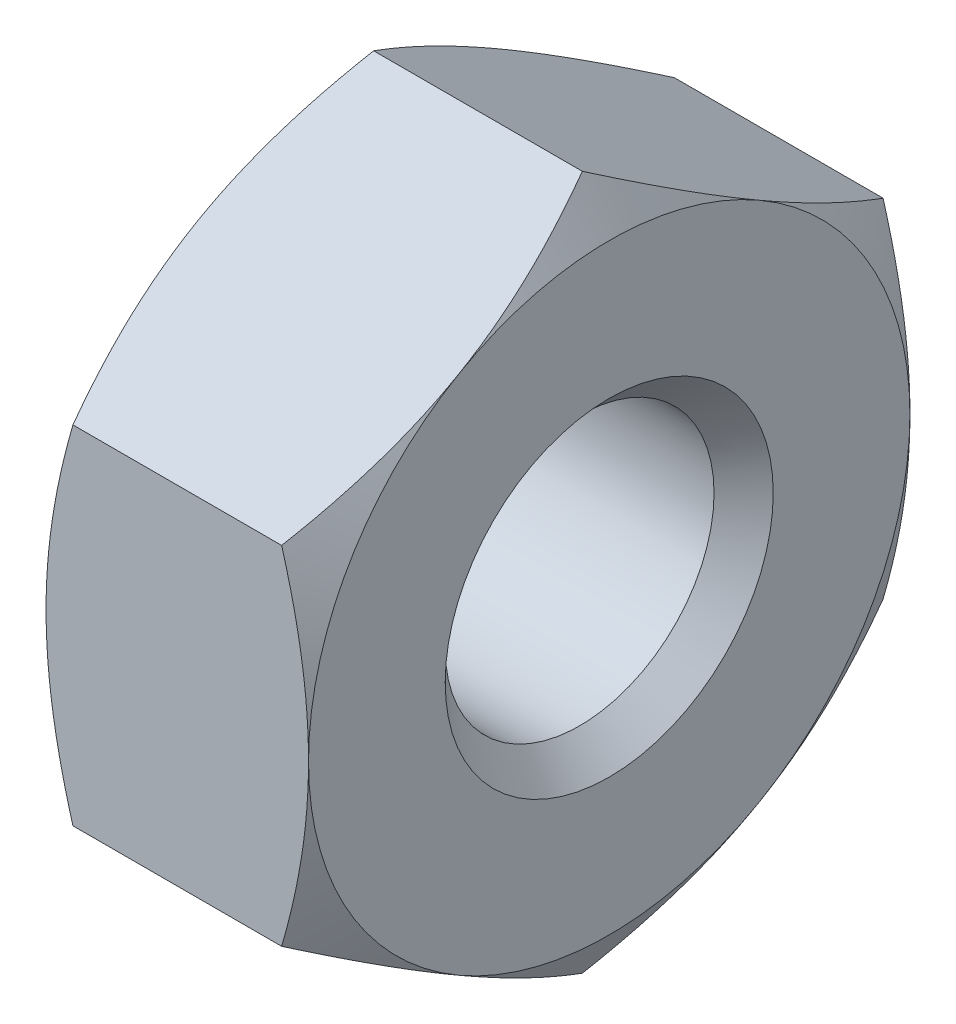
ISO-10303-21;
HEADER;
FILE_DESCRIPTION(('STEP AP214'),'2;1');
FILE_NAME('part.step','',(''),(''),'','','');
FILE_SCHEMA(('AUTOMOTIVE_DESIGN { 1 0 10303 214 1 1 1 1 }'));
ENDSEC;
DATA;
#1=APPLICATION_CONTEXT('core data for automotive mechanical design processes');
#2=APPLICATION_PROTOCOL_DEFINITION('international standard','automotive_design',2000,#1);
#3=PRODUCT_CONTEXT('',#1,'mechanical');
#4=PRODUCT('Part','Part','',(#3));
#5=PRODUCT_RELATED_PRODUCT_CATEGORY('part','',(#4));
#6=PRODUCT_DEFINITION_FORMATION('','',#4);
#7=PRODUCT_DEFINITION_CONTEXT('part definition',#1,'design');
#8=PRODUCT_DEFINITION('design','',#6,#7);
#9=PRODUCT_DEFINITION_SHAPE('','',#8);
#10=(LENGTH_UNIT() NAMED_UNIT(*) SI_UNIT(.MILLI.,.METRE.));
#11=(NAMED_UNIT(*) PLANE_ANGLE_UNIT() SI_UNIT($,.RADIAN.));
#12=(NAMED_UNIT(*) SI_UNIT($,.STERADIAN.) SOLID_ANGLE_UNIT());
#13=UNCERTAINTY_MEASURE_WITH_UNIT(LENGTH_MEASURE(1.E-05),#10,'distance_accuracy_value','');
#14=(GEOMETRIC_REPRESENTATION_CONTEXT(3) GLOBAL_UNCERTAINTY_ASSIGNED_CONTEXT((#13)) GLOBAL_UNIT_ASSIGNED_CONTEXT((#10,
#11,#12)) REPRESENTATION_CONTEXT('',''));
#15=CARTESIAN_POINT('',(0.,0.,0.));
#16=DIRECTION('',(0.,0.,1.));
#17=DIRECTION('',(1.,0.,0.));
#18=AXIS2_PLACEMENT_3D('',#15,#16,#17);
#19=CARTESIAN_POINT('',(0.,0.,0.));
#20=DIRECTION('',(1.,0.,0.));
#21=DIRECTION('',(0.,0.,1.));
#22=AXIS2_PLACEMENT_3D('',#19,#20,#21);
#23=CONICAL_SURFACE('',#22,2.75,1.0471975511966);
#24=CARTESIAN_POINT('',(0.245620759728892,3.17542763524348,1.99999999944489E-06));
#25=CARTESIAN_POINT('',(0.205327079520912,3.1056572343859,-0.120843879149777));
#26=CARTESIAN_POINT('',(0.168682077822843,3.0352845764636,-0.242732898134862));
#27=CARTESIAN_POINT('',(0.104719308771692,2.89332080353209,-0.488621365686415));
#28=CARTESIAN_POINT('',(0.0774241665851171,2.8217271669107,-0.612625181813276));
#29=CARTESIAN_POINT('',(0.034937283661472,2.67942711830248,-0.85909609592224));
#30=CARTESIAN_POINT('',(0.0194627366459233,2.60874259494818,-0.981525281680671));
#31=CARTESIAN_POINT('',(0.000992766186027702,2.46704112543365,-1.22695942638702));
#32=CARTESIAN_POINT('',(-0.0020179556121169,2.39602469397096,-1.34996349385262));
#33=CARTESIAN_POINT('',(0.00426116103712223,2.26333795804424,-1.57978366196818));
#34=CARTESIAN_POINT('',(0.012009268162101,2.20164774348584,-1.68663424791315));
#35=CARTESIAN_POINT('',(0.0365613195425177,2.07866920625298,-1.89963932264097));
#36=CARTESIAN_POINT('',(0.0533736426310831,2.01738130861525,-2.0057930752386));
#37=CARTESIAN_POINT('',(0.095401221983037,1.89414942122551,-2.21923696531023));
#38=CARTESIAN_POINT('',(0.120794548399385,1.83222102037136,-2.32650010202111));
#39=CARTESIAN_POINT('',(0.178426673811212,1.7092876169422,-2.53942700270777));
#40=CARTESIAN_POINT('',(0.21065194012458,1.6482810406466,-2.64509349244758));
#41=CARTESIAN_POINT('',(0.245620759728892,1.58771208557093,-2.750002));
#42=B_SPLINE_CURVE_WITH_KNOTS('',3,(#24,#25,#26,#27,#28,#29,#30,#31,#32,#33,#34,#35,#36,#37,#38,
#39,#40,#41),.UNSPECIFIED.,.F.,.F.,(4,2,2,2,2,2,2,2,4),(0.,0.435897174011014,0.87284181898307,
1.29897342204202,1.72458182710171,2.0950998279895,2.46596091919292,2.84504596377344,
3.22338701890322),.UNSPECIFIED.);
#43=CARTESIAN_POINT('',(0.,2.38156986040721,-1.375));
#44=VERTEX_POINT('',#43);
#45=CARTESIAN_POINT('',(0.245620093061863,1.58771324027147,-2.75));
#46=VERTEX_POINT('',#45);
#47=EDGE_CURVE('E223',#44,#46,#42,.T.);
#48=ORIENTED_EDGE('',*,*,#47,.T.);
#49=CARTESIAN_POINT('',(1.31598031828827,4.21091544038396,-2.75));
#50=CARTESIAN_POINT('',(1.25763129281631,4.09017437588851,-2.75));
#51=CARTESIAN_POINT('',(1.19986228473724,3.96914784711613,-2.75));
#52=CARTESIAN_POINT('',(1.08581574378868,3.72636951096204,-2.75));
#53=CARTESIAN_POINT('',(1.02953846913601,3.6046175824246,-2.75));
#54=CARTESIAN_POINT('',(0.918510378087251,3.35957643515293,-2.75));
#55=CARTESIAN_POINT('',(0.863770139348162,3.23628240631407,-2.75));
#56=CARTESIAN_POINT('',(0.756640792709624,2.98868100437406,-2.75));
#57=CARTESIAN_POINT('',(0.704251562262125,2.86437368449152,-2.75));
#58=CARTESIAN_POINT('',(0.60182730749714,2.61300450954009,-2.75));
#59=CARTESIAN_POINT('',(0.551829090773718,2.48592757393808,-2.75));
#60=CARTESIAN_POINT('',(0.45574834270771,2.23027484276221,-2.75));
#61=CARTESIAN_POINT('',(0.409666247004994,2.10169888223727,-2.75));
#62=CARTESIAN_POINT('',(0.322655906070147,1.84310760285607,-2.75));
#63=CARTESIAN_POINT('',(0.281716704347811,1.71309600867851,-2.75));
#64=CARTESIAN_POINT('',(0.206321681339341,1.45122453211976,-2.75));
#65=CARTESIAN_POINT('',(0.171863809844816,1.3193652484388,-2.75));
#66=CARTESIAN_POINT('',(0.1111042484744,1.05370835973643,-2.75));
#67=CARTESIAN_POINT('',(0.0848047267768665,0.919910249320773,-2.75));
#68=CARTESIAN_POINT('',(0.042132546645187,0.650700809036248,-2.75));
#69=CARTESIAN_POINT('',(0.0257598969149737,0.515289477753007,-2.75));
#70=CARTESIAN_POINT('',(0.00438986617478565,0.244419787628744,-2.75));
#71=CARTESIAN_POINT('',(-0.000679536122141642,0.108967258717272,-2.75));
#72=CARTESIAN_POINT('',(0.000826276527007458,-0.161843059976619,-2.75));
#73=CARTESIAN_POINT('',(0.00739846842524126,-0.297200865225814,-2.75));
#74=CARTESIAN_POINT('',(0.0280994035551231,-0.528341855784545,-2.75));
#75=CARTESIAN_POINT('',(0.0395319024612408,-0.624380039942036,-2.75));
#76=CARTESIAN_POINT('',(0.0675138831846853,-0.815714586504113,-2.75));
#77=CARTESIAN_POINT('',(0.0840641719491276,-0.91101082949224,-2.75));
#78=CARTESIAN_POINT('',(0.140523133233704,-1.19570893930552,-2.75));
#79=CARTESIAN_POINT('',(0.187225365576717,-1.38377638238591,-2.75));
#80=CARTESIAN_POINT('',(0.267774655720935,-1.66519083702709,-2.75));
#81=CARTESIAN_POINT('',(0.296784391565029,-1.76000470576513,-2.75));
#82=CARTESIAN_POINT('',(0.357674532213624,-1.94864284283357,-2.75));
#83=CARTESIAN_POINT('',(0.38955295707536,-2.0424677445283,-2.75));
#84=CARTESIAN_POINT('',(0.455517130283087,-2.22873560264422,-2.75));
#85=CARTESIAN_POINT('',(0.489589444605965,-2.32118336499496,-2.75));
#86=CARTESIAN_POINT('',(0.559734023788579,-2.5053616066891,-2.75));
#87=CARTESIAN_POINT('',(0.595807096904655,-2.59709177881638,-2.75));
#88=CARTESIAN_POINT('',(0.632683115307689,-2.68849026920457,-2.75));
#89=B_SPLINE_CURVE_WITH_KNOTS('',3,(#49,#50,#51,#52,#53,#54,#55,#56,#57,#58,#59,#60,#61,#62,#63,
#64,#65,#66,#67,#68,#69,#70,#71,#72,#73,#74,#75,#76,#77,#78,#79,#80,#81,#82,#83,#84,#85,#86,#87,
#88),.UNSPECIFIED.,.F.,.F.,(4,2,2,2,2,2,2,2,2,2,2,2,2,2,2,2,2,2,2,4),(0.,0.402307675579642,
0.80468454116917,1.20936393187761,1.61402220381253,2.02364942710366,2.43332215894505,
2.84210675846266,3.25076183082299,3.65952541526239,4.06828935810731,4.47444123165121,
4.88048765257977,5.17049481634027,5.46054773029393,6.04108522031029,6.33851935652275,
6.63574975827877,6.93130717624915,7.22698487417713),.UNSPECIFIED.);
#90=CARTESIAN_POINT('',(0.,0.,-2.75));
#91=VERTEX_POINT('',#90);
#92=EDGE_CURVE('E119',#46,#91,#89,.T.);
#93=ORIENTED_EDGE('',*,*,#92,.T.);
#94=CARTESIAN_POINT('',(0.,0.,0.));
#95=DIRECTION('',(-1.,0.,0.));
#96=DIRECTION('',(0.,0.,-1.));
#97=AXIS2_PLACEMENT_3D('',#94,#95,#96);
#98=CIRCLE('',#97,2.75);
#99=EDGE_CURVE('E257',#44,#91,#98,.T.);
#100=ORIENTED_EDGE('',*,*,#99,.F.);
#101=EDGE_LOOP('',(#48,#93,#100));
#102=FACE_BOUND('',#101,.T.);
#103=ADVANCED_FACE('F16',(#102),#23,.T.);
#104=CARTESIAN_POINT('',(0.,-2.38156986040721,-1.375));
#105=VERTEX_POINT('',#104);
#106=EDGE_CURVE('E249',#91,#105,#98,.T.);
#107=ORIENTED_EDGE('',*,*,#106,.F.);
#108=CARTESIAN_POINT('',(0.245620093061863,-1.58771324027147,-2.75));
#109=VERTEX_POINT('',#108);
#110=EDGE_CURVE('E217',#91,#109,#89,.T.);
#111=ORIENTED_EDGE('',*,*,#110,.T.);
#112=CARTESIAN_POINT('',(0.245620759728893,-1.58771208557094,-2.750002));
#113=CARTESIAN_POINT('',(0.205327079520912,-1.65748248642851,-2.62915612085022));
#114=CARTESIAN_POINT('',(0.168682077822844,-1.72785514435081,-2.50726710186514));
#115=CARTESIAN_POINT('',(0.104719308771692,-1.86981891728232,-2.26137863431358));
#116=CARTESIAN_POINT('',(0.0774241665851174,-1.94141255390371,-2.13737481818672));
#117=CARTESIAN_POINT('',(0.0349372836614722,-2.08371260251193,-1.89090390407776));
#118=CARTESIAN_POINT('',(0.0194627366459232,-2.15439712586623,-1.76847471831933));
#119=CARTESIAN_POINT('',(0.00099276618602787,-2.29609859538076,-1.52304057361298));
#120=CARTESIAN_POINT('',(-0.00201795561211625,-2.36711502684345,-1.40003650614738));
#121=CARTESIAN_POINT('',(0.00426116103712294,-2.49980176277018,-1.17021633803182));
#122=CARTESIAN_POINT('',(0.0120092681621013,-2.56149197732857,-1.06336575208685));
#123=CARTESIAN_POINT('',(0.0365613195425178,-2.68447051456143,-0.850360677359029));
#124=CARTESIAN_POINT('',(0.0533736426310834,-2.74575841219916,-0.744206924761402));
#125=CARTESIAN_POINT('',(0.0954012219830374,-2.8689902995889,-0.530763034689772));
#126=CARTESIAN_POINT('',(0.120794548399385,-2.93091870044305,-0.423499897978883));
#127=CARTESIAN_POINT('',(0.178426673811212,-3.05385210387221,-0.210572997292224));
#128=CARTESIAN_POINT('',(0.21065194012458,-3.1148586801678,-0.104906507552424));
#129=CARTESIAN_POINT('',(0.245620759728893,-3.17542763524348,2.00000000039211E-06));
#130=B_SPLINE_CURVE_WITH_KNOTS('',3,(#112,#113,#114,#115,#116,#117,#118,#119,#120,#121,#122,
#123,#124,#125,#126,#127,#128,#129),.UNSPECIFIED.,.F.,.F.,(4,2,2,2,2,2,2,2,4),(0.,
0.435897174011014,0.87284181898307,1.29897342204202,1.72458182710172,2.0950998279895,
2.46596091919292,2.84504596377344,3.22338701890322),.UNSPECIFIED.);
#131=EDGE_CURVE('E211',#109,#105,#130,.T.);
#132=ORIENTED_EDGE('',*,*,#131,.T.);
#133=EDGE_LOOP('',(#107,#111,#132));
#134=FACE_BOUND('',#133,.T.);
#135=ADVANCED_FACE('F246',(#134),#23,.T.);
#136=CARTESIAN_POINT('',(0.,-2.38156986040721,1.375));
#137=VERTEX_POINT('',#136);
#138=EDGE_CURVE('E255',#105,#137,#98,.T.);
#139=ORIENTED_EDGE('',*,*,#138,.F.);
#140=CARTESIAN_POINT('',(0.245620093061863,-3.17542648054294,0.));
#141=VERTEX_POINT('',#140);
#142=EDGE_CURVE('E203',#105,#141,#130,.T.);
#143=ORIENTED_EDGE('',*,*,#142,.T.);
#144=CARTESIAN_POINT('',(0.245620759728893,-3.17542763524348,-1.99999999980557E-06));
#145=CARTESIAN_POINT('',(0.205327079520913,-3.1056572343859,0.120843879149777));
#146=CARTESIAN_POINT('',(0.168682077822845,-3.0352845764636,0.242732898134863));
#147=CARTESIAN_POINT('',(0.104719308771693,-2.89332080353209,0.488621365686416));
#148=CARTESIAN_POINT('',(0.0774241665851182,-2.8217271669107,0.612625181813277));
#149=CARTESIAN_POINT('',(0.0349372836614732,-2.67942711830248,0.859096095922241));
#150=CARTESIAN_POINT('',(0.0194627366459245,-2.60874259494818,0.981525281680672));
#151=CARTESIAN_POINT('',(0.000992766186028424,-2.46704112543365,1.22695942638702));
#152=CARTESIAN_POINT('',(-0.00201795561211686,-2.39602469397096,1.34996349385262));
#153=CARTESIAN_POINT('',(0.00426116103712228,-2.26333795804424,1.57978366196818));
#154=CARTESIAN_POINT('',(0.0120092681621015,-2.20164774348584,1.68663424791315));
#155=CARTESIAN_POINT('',(0.0365613195425186,-2.07866920625298,1.89963932264097));
#156=CARTESIAN_POINT('',(0.053373642631084,-2.01738130861525,2.0057930752386));
#157=CARTESIAN_POINT('',(0.0954012219830377,-1.89414942122551,2.21923696531023));
#158=CARTESIAN_POINT('',(0.120794548399386,-1.83222102037136,2.32650010202112));
#159=CARTESIAN_POINT('',(0.178426673811212,-1.7092876169422,2.53942700270778));
#160=CARTESIAN_POINT('',(0.21065194012458,-1.64828104064661,2.64509349244758));
#161=CARTESIAN_POINT('',(0.245620759728892,-1.58771208557093,2.750002));
#162=B_SPLINE_CURVE_WITH_KNOTS('',3,(#144,#145,#146,#147,#148,#149,#150,#151,#152,#153,#154,
#155,#156,#157,#158,#159,#160,#161),.UNSPECIFIED.,.F.,.F.,(4,2,2,2,2,2,2,2,4),(0.,
0.435897174011014,0.87284181898307,1.29897342204202,1.72458182710171,2.0950998279895,
2.46596091919292,2.84504596377344,3.22338701890322),.UNSPECIFIED.);
#163=EDGE_CURVE('E537',#141,#137,#162,.T.);
#164=ORIENTED_EDGE('',*,*,#163,.T.);
#165=EDGE_LOOP('',(#139,#143,#164));
#166=FACE_BOUND('',#165,.T.);
#167=ADVANCED_FACE('F337',(#166),#23,.T.);
#168=CARTESIAN_POINT('',(0.245620759728892,1.58771208557094,2.750002));
#169=CARTESIAN_POINT('',(0.205327079520912,1.65748248642851,2.62915612085022));
#170=CARTESIAN_POINT('',(0.168682077822843,1.72785514435081,2.50726710186514));
#171=CARTESIAN_POINT('',(0.104719308771692,1.86981891728232,2.26137863431358));
#172=CARTESIAN_POINT('',(0.0774241665851166,1.94141255390371,2.13737481818672));
#173=CARTESIAN_POINT('',(0.0349372836614714,2.08371260251193,1.89090390407776));
#174=CARTESIAN_POINT('',(0.0194627366459225,2.15439712586623,1.76847471831933));
#175=CARTESIAN_POINT('',(0.000992766186027394,2.29609859538076,1.52304057361298));
#176=CARTESIAN_POINT('',(-0.00201795561211666,2.36711502684345,1.40003650614738));
#177=CARTESIAN_POINT('',(0.00426116103712259,2.49980176277018,1.17021633803182));
#178=CARTESIAN_POINT('',(0.0120092681621009,2.56149197732857,1.06336575208685));
#179=CARTESIAN_POINT('',(0.0365613195425173,2.68447051456143,0.850360677359028));
#180=CARTESIAN_POINT('',(0.0533736426310829,2.74575841219916,0.744206924761401));
#181=CARTESIAN_POINT('',(0.0954012219830367,2.8689902995889,0.530763034689772));
#182=CARTESIAN_POINT('',(0.120794548399385,2.93091870044305,0.423499897978884));
#183=CARTESIAN_POINT('',(0.178426673811211,3.05385210387221,0.210572997292224));
#184=CARTESIAN_POINT('',(0.21065194012458,3.1148586801678,0.104906507552423));
#185=CARTESIAN_POINT('',(0.245620759728893,3.17542763524348,-2.00000000073064E-06));
#186=B_SPLINE_CURVE_WITH_KNOTS('',3,(#168,#169,#170,#171,#172,#173,#174,#175,#176,#177,#178,
#179,#180,#181,#182,#183,#184,#185),.UNSPECIFIED.,.F.,.F.,(4,2,2,2,2,2,2,2,4),(0.,
0.435897174011015,0.87284181898307,1.29897342204202,1.72458182710172,2.0950998279895,
2.46596091919292,2.84504596377344,3.22338701890322),.UNSPECIFIED.);
#187=CARTESIAN_POINT('',(0.,2.38156986040721,1.375));
#188=VERTEX_POINT('',#187);
#189=CARTESIAN_POINT('',(0.245620093061863,3.17542648054294,0.));
#190=VERTEX_POINT('',#189);
#191=EDGE_CURVE('E364',#188,#190,#186,.T.);
#192=ORIENTED_EDGE('',*,*,#191,.T.);
#193=EDGE_CURVE('E212',#190,#44,#42,.T.);
#194=ORIENTED_EDGE('',*,*,#193,.T.);
#195=EDGE_CURVE('E266',#188,#44,#98,.T.);
#196=ORIENTED_EDGE('',*,*,#195,.F.);
#197=EDGE_LOOP('',(#192,#194,#196));
#198=FACE_BOUND('',#197,.T.);
#199=ADVANCED_FACE('F345',(#198),#23,.T.);
#200=CARTESIAN_POINT('',(0.,0.,2.75));
#201=VERTEX_POINT('',#200);
#202=EDGE_CURVE('E263',#137,#201,#98,.T.);
#203=ORIENTED_EDGE('',*,*,#202,.F.);
#204=CARTESIAN_POINT('',(0.245620093061863,-1.58771324027147,2.75));
#205=VERTEX_POINT('',#204);
#206=EDGE_CURVE('E38',#137,#205,#162,.T.);
#207=ORIENTED_EDGE('',*,*,#206,.T.);
#208=CARTESIAN_POINT('',(1.31598031828827,4.21091544038396,2.75));
#209=CARTESIAN_POINT('',(1.25763129281631,4.09017437588851,2.75));
#210=CARTESIAN_POINT('',(1.19986228473724,3.96914784711613,2.75));
#211=CARTESIAN_POINT('',(1.08581574378868,3.72636951096204,2.75));
#212=CARTESIAN_POINT('',(1.02953846913601,3.6046175824246,2.75));
#213=CARTESIAN_POINT('',(0.91851037808725,3.35957643515293,2.75));
#214=CARTESIAN_POINT('',(0.863770139348161,3.23628240631407,2.75));
#215=CARTESIAN_POINT('',(0.756640792709623,2.98868100437406,2.75));
#216=CARTESIAN_POINT('',(0.704251562262124,2.86437368449152,2.75));
#217=CARTESIAN_POINT('',(0.601827307497139,2.61300450954009,2.75));
#218=CARTESIAN_POINT('',(0.551829090773717,2.48592757393808,2.75));
#219=CARTESIAN_POINT('',(0.45574834270771,2.23027484276222,2.75));
#220=CARTESIAN_POINT('',(0.409666247004994,2.10169888223727,2.75));
#221=CARTESIAN_POINT('',(0.322655906070147,1.84310760285608,2.75));
#222=CARTESIAN_POINT('',(0.281716704347811,1.71309600867851,2.75));
#223=CARTESIAN_POINT('',(0.206321681339341,1.45122453211976,2.75));
#224=CARTESIAN_POINT('',(0.171863809844816,1.3193652484388,2.75));
#225=CARTESIAN_POINT('',(0.1111042484744,1.05370835973643,2.75));
#226=CARTESIAN_POINT('',(0.0848047267768668,0.919910249320777,2.75));
#227=CARTESIAN_POINT('',(0.0421325466451874,0.650700809036252,2.75));
#228=CARTESIAN_POINT('',(0.025759896914974,0.515289477753011,2.75));
#229=CARTESIAN_POINT('',(0.00438986617478597,0.244419787628747,2.75));
#230=CARTESIAN_POINT('',(-0.000679536122141217,0.108967258717275,2.75));
#231=CARTESIAN_POINT('',(0.000826276527007704,-0.161843059976616,2.75));
#232=CARTESIAN_POINT('',(0.00739846842524119,-0.297200865225811,2.75));
#233=CARTESIAN_POINT('',(0.028099403555123,-0.528341855784542,2.75));
#234=CARTESIAN_POINT('',(0.039531902461241,-0.624380039942033,2.75));
#235=CARTESIAN_POINT('',(0.0675138831846856,-0.81571458650411,2.75));
#236=CARTESIAN_POINT('',(0.084064171949128,-0.911010829492236,2.75));
#237=CARTESIAN_POINT('',(0.140523133233705,-1.19570893930552,2.75));
#238=CARTESIAN_POINT('',(0.187225365576717,-1.38377638238591,2.75));
#239=CARTESIAN_POINT('',(0.267774655720935,-1.66519083702709,2.75));
#240=CARTESIAN_POINT('',(0.296784391565029,-1.76000470576512,2.75));
#241=CARTESIAN_POINT('',(0.357674532213624,-1.94864284283356,2.75));
#242=CARTESIAN_POINT('',(0.38955295707536,-2.0424677445283,2.75));
#243=CARTESIAN_POINT('',(0.455517130283087,-2.22873560264421,2.75));
#244=CARTESIAN_POINT('',(0.489589444605965,-2.32118336499495,2.75));
#245=CARTESIAN_POINT('',(0.559734023788579,-2.50536160668909,2.75));
#246=CARTESIAN_POINT('',(0.595807096904655,-2.59709177881638,2.75));
#247=CARTESIAN_POINT('',(0.632683115307689,-2.68849026920456,2.75));
#248=B_SPLINE_CURVE_WITH_KNOTS('',3,(#208,#209,#210,#211,#212,#213,#214,#215,#216,#217,#218,
#219,#220,#221,#222,#223,#224,#225,#226,#227,#228,#229,#230,#231,#232,#233,#234,#235,#236,#237,
#238,#239,#240,#241,#242,#243,#244,#245,#246,#247),.UNSPECIFIED.,.F.,.F.,(4,2,2,2,2,2,2,2,2,2,2,
2,2,2,2,2,2,2,2,4),(0.,0.402307675579642,0.80468454116917,1.20936393187761,1.61402220381253,
2.02364942710366,2.43332215894505,2.84210675846266,3.25076183082298,3.65952541526239,
4.06828935810731,4.47444123165121,4.88048765257976,5.17049481634026,5.46054773029392,
6.04108522031028,6.33851935652275,6.63574975827877,6.93130717624914,7.22698487417713),.UNSPECIFIED.);
#249=EDGE_CURVE('E11',#205,#201,#248,.F.);
#250=ORIENTED_EDGE('',*,*,#249,.T.);
#251=EDGE_LOOP('',(#203,#207,#250));
#252=FACE_BOUND('',#251,.T.);
#253=ADVANCED_FACE('F340',(#252),#23,.T.);
#254=CARTESIAN_POINT('',(0.245620093061863,1.58771324027147,2.75));
#255=VERTEX_POINT('',#254);
#256=EDGE_CURVE('E21',#201,#255,#248,.F.);
#257=ORIENTED_EDGE('',*,*,#256,.T.);
#258=EDGE_CURVE('E126',#255,#188,#186,.T.);
#259=ORIENTED_EDGE('',*,*,#258,.T.);
#260=EDGE_CURVE('E273',#201,#188,#98,.T.);
#261=ORIENTED_EDGE('',*,*,#260,.F.);
#262=EDGE_LOOP('',(#257,#259,#261));
#263=FACE_BOUND('',#262,.T.);
#264=ADVANCED_FACE('F153',(#263),#23,.T.);
#265=CARTESIAN_POINT('',(2.15390444775792,0.,0.));
#266=DIRECTION('',(-1.,0.,0.));
#267=DIRECTION('',(0.,0.,-1.));
#268=AXIS2_PLACEMENT_3D('',#265,#266,#267);
#269=CONICAL_SURFACE('',#268,3.17625,1.0471975511966);
#270=CARTESIAN_POINT('',(1.08401968171173,4.21091544038396,2.75));
#271=CARTESIAN_POINT('',(1.14236870718369,4.09017437588851,2.75));
#272=CARTESIAN_POINT('',(1.20013771526276,3.96914784711613,2.75));
#273=CARTESIAN_POINT('',(1.31418425621132,3.72636951096204,2.75));
#274=CARTESIAN_POINT('',(1.37046153086399,3.6046175824246,2.75));
#275=CARTESIAN_POINT('',(1.48148962191275,3.35957643515293,2.75));
#276=CARTESIAN_POINT('',(1.53622986065184,3.23628240631406,2.75));
#277=CARTESIAN_POINT('',(1.64335920729037,2.98868100437406,2.75));
#278=CARTESIAN_POINT('',(1.69574843773787,2.86437368449152,2.75));
#279=CARTESIAN_POINT('',(1.79817269250286,2.61300450954009,2.75));
#280=CARTESIAN_POINT('',(1.84817090922628,2.48592757393808,2.75));
#281=CARTESIAN_POINT('',(1.94425165729229,2.23027484276221,2.75));
#282=CARTESIAN_POINT('',(1.990333752995,2.10169888223727,2.75));
#283=CARTESIAN_POINT('',(2.07734409392985,1.84310760285608,2.75));
#284=CARTESIAN_POINT('',(2.11828329565219,1.71309600867851,2.75));
#285=CARTESIAN_POINT('',(2.19367831866066,1.45122453211976,2.75));
#286=CARTESIAN_POINT('',(2.22813619015519,1.3193652484388,2.75));
#287=CARTESIAN_POINT('',(2.2888957515256,1.05370835973644,2.75));
#288=CARTESIAN_POINT('',(2.31519527322313,0.919910249320777,2.75));
#289=CARTESIAN_POINT('',(2.35786745335481,0.650700809036252,2.75));
#290=CARTESIAN_POINT('',(2.37424010308502,0.515289477753011,2.75));
#291=CARTESIAN_POINT('',(2.39561013382521,0.244419787628747,2.75));
#292=CARTESIAN_POINT('',(2.40067953612214,0.108967258717275,2.75));
#293=CARTESIAN_POINT('',(2.39917372347299,-0.161843059976616,2.75));
#294=CARTESIAN_POINT('',(2.39260153157476,-0.297200865225811,2.75));
#295=CARTESIAN_POINT('',(2.37190059644488,-0.528341855784542,2.75));
#296=CARTESIAN_POINT('',(2.36046809753876,-0.624380039942033,2.75));
#297=CARTESIAN_POINT('',(2.33248611681531,-0.81571458650411,2.75));
#298=CARTESIAN_POINT('',(2.31593582805087,-0.911010829492237,2.75));
#299=CARTESIAN_POINT('',(2.25947686676629,-1.19570893930552,2.75));
#300=CARTESIAN_POINT('',(2.21277463442328,-1.38377638238591,2.75));
#301=CARTESIAN_POINT('',(2.13222534427906,-1.66519083702709,2.75));
#302=CARTESIAN_POINT('',(2.10321560843497,-1.76000470576513,2.75));
#303=CARTESIAN_POINT('',(2.04232546778637,-1.94864284283357,2.75));
#304=CARTESIAN_POINT('',(2.01044704292464,-2.0424677445283,2.75));
#305=CARTESIAN_POINT('',(1.94448286971691,-2.22873560264421,2.75));
#306=CARTESIAN_POINT('',(1.91041055539403,-2.32118336499495,2.75));
#307=CARTESIAN_POINT('',(1.84026597621142,-2.5053616066891,2.75));
#308=CARTESIAN_POINT('',(1.80419290309534,-2.59709177881638,2.75));
#309=CARTESIAN_POINT('',(1.76731688469231,-2.68849026920457,2.75));
#310=B_SPLINE_CURVE_WITH_KNOTS('',3,(#270,#271,#272,#273,#274,#275,#276,#277,#278,#279,#280,
#281,#282,#283,#284,#285,#286,#287,#288,#289,#290,#291,#292,#293,#294,#295,#296,#297,#298,#299,
#300,#301,#302,#303,#304,#305,#306,#307,#308,#309),.UNSPECIFIED.,.F.,.F.,(4,2,2,2,2,2,2,2,2,2,2,
2,2,2,2,2,2,2,2,4),(0.,0.402307675579641,0.804684541169169,1.20936393187761,1.61402220381253,
2.02364942710366,2.43332215894505,2.84210675846266,3.25076183082298,3.65952541526239,
4.06828935810731,4.47444123165121,4.88048765257976,5.17049481634026,5.46054773029392,
6.04108522031028,6.33851935652275,6.63574975827877,6.93130717624915,7.22698487417713),.UNSPECIFIED.);
#311=CARTESIAN_POINT('',(2.4,0.,2.75));
#312=VERTEX_POINT('',#311);
#313=CARTESIAN_POINT('',(2.15437990693814,-1.58771324027147,2.75));
#314=VERTEX_POINT('',#313);
#315=EDGE_CURVE('E115',#312,#314,#310,.T.);
#316=ORIENTED_EDGE('',*,*,#315,.T.);
#317=CARTESIAN_POINT('',(2.15437924027111,-1.58771208557093,2.750002));
#318=CARTESIAN_POINT('',(2.19467292047909,-1.65748248642851,2.62915612085022));
#319=CARTESIAN_POINT('',(2.23131792217715,-1.72785514435081,2.50726710186514));
#320=CARTESIAN_POINT('',(2.2952806912283,-1.86981891728232,2.26137863431359));
#321=CARTESIAN_POINT('',(2.32257583341488,-1.94141255390371,2.13737481818672));
#322=CARTESIAN_POINT('',(2.36506271633853,-2.08371260251193,1.89090390407776));
#323=CARTESIAN_POINT('',(2.38053726335407,-2.15439712586623,1.76847471831933));
#324=CARTESIAN_POINT('',(2.39900723381397,-2.29609859538076,1.52304057361299));
#325=CARTESIAN_POINT('',(2.40201795561212,-2.36711502684345,1.40003650614739));
#326=CARTESIAN_POINT('',(2.39573883896288,-2.49980176277017,1.17021633803182));
#327=CARTESIAN_POINT('',(2.3879907318379,-2.56149197732857,1.06336575208685));
#328=CARTESIAN_POINT('',(2.36343868045748,-2.68447051456143,0.850360677359034));
#329=CARTESIAN_POINT('',(2.34662635736891,-2.74575841219916,0.744206924761406));
#330=CARTESIAN_POINT('',(2.30459877801696,-2.8689902995889,0.530763034689776));
#331=CARTESIAN_POINT('',(2.27920545160061,-2.93091870044305,0.423499897978887));
#332=CARTESIAN_POINT('',(2.22157332618879,-3.05385210387221,0.210572997292227));
#333=CARTESIAN_POINT('',(2.18934805987542,-3.11485868016781,0.104906507552426));
#334=CARTESIAN_POINT('',(2.15437924027111,-3.17542763524348,-2.00000000010692E-06));
#335=B_SPLINE_CURVE_WITH_KNOTS('',3,(#317,#318,#319,#320,#321,#322,#323,#324,#325,#326,#327,
#328,#329,#330,#331,#332,#333,#334),.UNSPECIFIED.,.F.,.F.,(4,2,2,2,2,2,2,2,4),(0.,
0.435897174011013,0.872841818983067,1.29897342204202,1.72458182710171,2.0950998279895,
2.46596091919292,2.84504596377344,3.22338701890322),.UNSPECIFIED.);
#336=CARTESIAN_POINT('',(2.4,-2.38156986040721,1.375));
#337=VERTEX_POINT('',#336);
#338=EDGE_CURVE('E121',#314,#337,#335,.T.);
#339=ORIENTED_EDGE('',*,*,#338,.T.);
#340=CARTESIAN_POINT('',(2.4,0.,0.));
#341=DIRECTION('',(-1.,0.,0.));
#342=DIRECTION('',(0.,0.,-1.));
#343=AXIS2_PLACEMENT_3D('',#340,#341,#342);
#344=CIRCLE('',#343,2.75);
#345=EDGE_CURVE('E129',#337,#312,#344,.T.);
#346=ORIENTED_EDGE('',*,*,#345,.T.);
#347=EDGE_LOOP('',(#316,#339,#346));
#348=FACE_BOUND('',#347,.T.);
#349=ADVANCED_FACE('F128',(#348),#269,.T.);
#350=CARTESIAN_POINT('',(2.4,-2.38156986040721,-1.375));
#351=VERTEX_POINT('',#350);
#352=EDGE_CURVE('E276',#351,#337,#344,.T.);
#353=ORIENTED_EDGE('',*,*,#352,.T.);
#354=CARTESIAN_POINT('',(2.15437990693814,-3.17542648054294,0.));
#355=VERTEX_POINT('',#354);
#356=EDGE_CURVE('E45',#337,#355,#335,.T.);
#357=ORIENTED_EDGE('',*,*,#356,.T.);
#358=CARTESIAN_POINT('',(2.15437924027111,-3.17542763524348,2.00000000023987E-06));
#359=CARTESIAN_POINT('',(2.19467292047909,-3.1056572343859,-0.120843879149777));
#360=CARTESIAN_POINT('',(2.23131792217715,-3.0352845764636,-0.242732898134862));
#361=CARTESIAN_POINT('',(2.29528069122831,-2.89332080353209,-0.488621365686415));
#362=CARTESIAN_POINT('',(2.32257583341488,-2.8217271669107,-0.612625181813276));
#363=CARTESIAN_POINT('',(2.36506271633853,-2.67942711830248,-0.85909609592224));
#364=CARTESIAN_POINT('',(2.38053726335407,-2.60874259494818,-0.981525281680671));
#365=CARTESIAN_POINT('',(2.39900723381397,-2.46704112543365,-1.22695942638702));
#366=CARTESIAN_POINT('',(2.40201795561212,-2.39602469397096,-1.34996349385262));
#367=CARTESIAN_POINT('',(2.39573883896288,-2.26333795804424,-1.57978366196818));
#368=CARTESIAN_POINT('',(2.3879907318379,-2.20164774348584,-1.68663424791315));
#369=CARTESIAN_POINT('',(2.36343868045748,-2.07866920625298,-1.89963932264097));
#370=CARTESIAN_POINT('',(2.34662635736892,-2.01738130861525,-2.0057930752386));
#371=CARTESIAN_POINT('',(2.30459877801696,-1.89414942122551,-2.21923696531022));
#372=CARTESIAN_POINT('',(2.27920545160061,-1.83222102037136,-2.32650010202111));
#373=CARTESIAN_POINT('',(2.22157332618879,-1.7092876169422,-2.53942700270777));
#374=CARTESIAN_POINT('',(2.18934805987542,-1.64828104064661,-2.64509349244757));
#375=CARTESIAN_POINT('',(2.15437924027111,-1.58771208557094,-2.750002));
#376=B_SPLINE_CURVE_WITH_KNOTS('',3,(#358,#359,#360,#361,#362,#363,#364,#365,#366,#367,#368,
#369,#370,#371,#372,#373,#374,#375),.UNSPECIFIED.,.F.,.F.,(4,2,2,2,2,2,2,2,4),(0.,
0.435897174011014,0.872841818983069,1.29897342204202,1.72458182710171,2.0950998279895,
2.46596091919292,2.84504596377344,3.22338701890322),.UNSPECIFIED.);
#377=EDGE_CURVE('E189',#355,#351,#376,.T.);
#378=ORIENTED_EDGE('',*,*,#377,.T.);
#379=EDGE_LOOP('',(#353,#357,#378));
#380=FACE_BOUND('',#379,.T.);
#381=ADVANCED_FACE('F152',(#380),#269,.T.);
#382=CARTESIAN_POINT('',(2.4,0.,-2.75));
#383=VERTEX_POINT('',#382);
#384=EDGE_CURVE('E267',#383,#351,#344,.T.);
#385=ORIENTED_EDGE('',*,*,#384,.T.);
#386=CARTESIAN_POINT('',(2.15437990693814,-1.58771324027147,-2.75));
#387=VERTEX_POINT('',#386);
#388=EDGE_CURVE('E183',#351,#387,#376,.T.);
#389=ORIENTED_EDGE('',*,*,#388,.T.);
#390=CARTESIAN_POINT('',(1.08401968171173,4.21091544038396,-2.75));
#391=CARTESIAN_POINT('',(1.14236870718369,4.09017437588851,-2.75));
#392=CARTESIAN_POINT('',(1.20013771526276,3.96914784711613,-2.75));
#393=CARTESIAN_POINT('',(1.31418425621131,3.72636951096204,-2.75));
#394=CARTESIAN_POINT('',(1.37046153086399,3.6046175824246,-2.75));
#395=CARTESIAN_POINT('',(1.48148962191275,3.35957643515293,-2.75));
#396=CARTESIAN_POINT('',(1.53622986065184,3.23628240631406,-2.75));
#397=CARTESIAN_POINT('',(1.64335920729037,2.98868100437406,-2.75));
#398=CARTESIAN_POINT('',(1.69574843773787,2.86437368449152,-2.75));
#399=CARTESIAN_POINT('',(1.79817269250286,2.61300450954009,-2.75));
#400=CARTESIAN_POINT('',(1.84817090922628,2.48592757393808,-2.75));
#401=CARTESIAN_POINT('',(1.94425165729229,2.23027484276221,-2.75));
#402=CARTESIAN_POINT('',(1.990333752995,2.10169888223726,-2.75));
#403=CARTESIAN_POINT('',(2.07734409392985,1.84310760285607,-2.75));
#404=CARTESIAN_POINT('',(2.11828329565219,1.71309600867851,-2.75));
#405=CARTESIAN_POINT('',(2.19367831866066,1.45122453211976,-2.75));
#406=CARTESIAN_POINT('',(2.22813619015519,1.3193652484388,-2.75));
#407=CARTESIAN_POINT('',(2.2888957515256,1.05370835973643,-2.75));
#408=CARTESIAN_POINT('',(2.31519527322313,0.919910249320773,-2.75));
#409=CARTESIAN_POINT('',(2.35786745335481,0.650700809036248,-2.75));
#410=CARTESIAN_POINT('',(2.37424010308502,0.515289477753008,-2.75));
#411=CARTESIAN_POINT('',(2.39561013382521,0.244419787628744,-2.75));
#412=CARTESIAN_POINT('',(2.40067953612214,0.108967258717272,-2.75));
#413=CARTESIAN_POINT('',(2.39917372347299,-0.161843059976619,-2.75));
#414=CARTESIAN_POINT('',(2.39260153157476,-0.297200865225814,-2.75));
#415=CARTESIAN_POINT('',(2.37190059644488,-0.528341855784544,-2.75));
#416=CARTESIAN_POINT('',(2.36046809753876,-0.624380039942035,-2.75));
#417=CARTESIAN_POINT('',(2.33248611681531,-0.815714586504112,-2.75));
#418=CARTESIAN_POINT('',(2.31593582805087,-0.911010829492238,-2.75));
#419=CARTESIAN_POINT('',(2.25947686676629,-1.19570893930552,-2.75));
#420=CARTESIAN_POINT('',(2.21277463442328,-1.38377638238591,-2.75));
#421=CARTESIAN_POINT('',(2.13222534427906,-1.66519083702709,-2.75));
#422=CARTESIAN_POINT('',(2.10321560843497,-1.76000470576513,-2.75));
#423=CARTESIAN_POINT('',(2.04232546778637,-1.94864284283357,-2.75));
#424=CARTESIAN_POINT('',(2.01044704292464,-2.0424677445283,-2.75));
#425=CARTESIAN_POINT('',(1.94448286971691,-2.22873560264421,-2.75));
#426=CARTESIAN_POINT('',(1.91041055539403,-2.32118336499495,-2.75));
#427=CARTESIAN_POINT('',(1.84026597621142,-2.5053616066891,-2.75));
#428=CARTESIAN_POINT('',(1.80419290309534,-2.59709177881638,-2.75));
#429=CARTESIAN_POINT('',(1.76731688469231,-2.68849026920457,-2.75));
#430=B_SPLINE_CURVE_WITH_KNOTS('',3,(#390,#391,#392,#393,#394,#395,#396,#397,#398,#399,#400,
#401,#402,#403,#404,#405,#406,#407,#408,#409,#410,#411,#412,#413,#414,#415,#416,#417,#418,#419,
#420,#421,#422,#423,#424,#425,#426,#427,#428,#429),.UNSPECIFIED.,.F.,.F.,(4,2,2,2,2,2,2,2,2,2,2,
2,2,2,2,2,2,2,2,4),(0.,0.402307675579641,0.80468454116917,1.20936393187761,1.61402220381253,
2.02364942710366,2.43332215894505,2.84210675846266,3.25076183082299,3.65952541526239,
4.06828935810731,4.47444123165121,4.88048765257976,5.17049481634027,5.46054773029392,
6.04108522031029,6.33851935652275,6.63574975827877,6.93130717624915,7.22698487417713),.UNSPECIFIED.);
#431=EDGE_CURVE('E190',#387,#383,#430,.F.);
#432=ORIENTED_EDGE('',*,*,#431,.T.);
#433=EDGE_LOOP('',(#385,#389,#432));
#434=FACE_BOUND('',#433,.T.);
#435=ADVANCED_FACE('F386',(#434),#269,.T.);
#436=CARTESIAN_POINT('',(2.4,2.38156986040721,-1.375));
#437=VERTEX_POINT('',#436);
#438=EDGE_CURVE('E277',#437,#383,#344,.T.);
#439=ORIENTED_EDGE('',*,*,#438,.T.);
#440=CARTESIAN_POINT('',(2.15437990693814,1.58771324027147,-2.75));
#441=VERTEX_POINT('',#440);
#442=EDGE_CURVE('E177',#383,#441,#430,.F.);
#443=ORIENTED_EDGE('',*,*,#442,.T.);
#444=CARTESIAN_POINT('',(2.15437924027111,1.58771208557093,-2.750002));
#445=CARTESIAN_POINT('',(2.19467292047909,1.65748248642851,-2.62915612085022));
#446=CARTESIAN_POINT('',(2.23131792217715,1.72785514435081,-2.50726710186514));
#447=CARTESIAN_POINT('',(2.2952806912283,1.86981891728232,-2.26137863431359));
#448=CARTESIAN_POINT('',(2.32257583341488,1.94141255390371,-2.13737481818672));
#449=CARTESIAN_POINT('',(2.36506271633853,2.08371260251193,-1.89090390407776));
#450=CARTESIAN_POINT('',(2.38053726335407,2.15439712586623,-1.76847471831933));
#451=CARTESIAN_POINT('',(2.39900723381397,2.29609859538076,-1.52304057361298));
#452=CARTESIAN_POINT('',(2.40201795561212,2.36711502684345,-1.40003650614738));
#453=CARTESIAN_POINT('',(2.39573883896288,2.49980176277017,-1.17021633803182));
#454=CARTESIAN_POINT('',(2.3879907318379,2.56149197732857,-1.06336575208685));
#455=CARTESIAN_POINT('',(2.36343868045748,2.68447051456143,-0.850360677359032));
#456=CARTESIAN_POINT('',(2.34662635736891,2.74575841219916,-0.744206924761405));
#457=CARTESIAN_POINT('',(2.30459877801696,2.8689902995889,-0.530763034689775));
#458=CARTESIAN_POINT('',(2.27920545160061,2.93091870044305,-0.423499897978886));
#459=CARTESIAN_POINT('',(2.22157332618879,3.05385210387221,-0.210572997292226));
#460=CARTESIAN_POINT('',(2.18934805987542,3.1148586801678,-0.104906507552425));
#461=CARTESIAN_POINT('',(2.15437924027111,3.17542763524348,1.9999999995396E-06));
#462=B_SPLINE_CURVE_WITH_KNOTS('',3,(#444,#445,#446,#447,#448,#449,#450,#451,#452,#453,#454,
#455,#456,#457,#458,#459,#460,#461),.UNSPECIFIED.,.F.,.F.,(4,2,2,2,2,2,2,2,4),(0.,
0.435897174011013,0.872841818983069,1.29897342204202,1.72458182710171,2.0950998279895,
2.46596091919292,2.84504596377344,3.22338701890322),.UNSPECIFIED.);
#463=EDGE_CURVE('E619',#441,#437,#462,.T.);
#464=ORIENTED_EDGE('',*,*,#463,.T.);
#465=EDGE_LOOP('',(#439,#443,#464));
#466=FACE_BOUND('',#465,.T.);
#467=ADVANCED_FACE('F396',(#466),#269,.T.);
#468=CARTESIAN_POINT('',(2.4,2.38156986040721,1.375));
#469=VERTEX_POINT('',#468);
#470=EDGE_CURVE('E287',#469,#437,#344,.T.);
#471=ORIENTED_EDGE('',*,*,#470,.T.);
#472=CARTESIAN_POINT('',(2.15437990693814,3.17542648054294,0.));
#473=VERTEX_POINT('',#472);
#474=EDGE_CURVE('E171',#437,#473,#462,.T.);
#475=ORIENTED_EDGE('',*,*,#474,.T.);
#476=CARTESIAN_POINT('',(2.15437924027111,3.17542763524348,-2.00000000060922E-06));
#477=CARTESIAN_POINT('',(2.19467292047909,3.1056572343859,0.120843879149775));
#478=CARTESIAN_POINT('',(2.23131792217715,3.0352845764636,0.242732898134861));
#479=CARTESIAN_POINT('',(2.29528069122831,2.89332080353209,0.488621365686414));
#480=CARTESIAN_POINT('',(2.32257583341488,2.8217271669107,0.612625181813275));
#481=CARTESIAN_POINT('',(2.36506271633853,2.67942711830248,0.859096095922238));
#482=CARTESIAN_POINT('',(2.38053726335407,2.60874259494818,0.981525281680668));
#483=CARTESIAN_POINT('',(2.39900723381397,2.46704112543365,1.22695942638702));
#484=CARTESIAN_POINT('',(2.40201795561212,2.39602469397097,1.34996349385262));
#485=CARTESIAN_POINT('',(2.39573883896288,2.26333795804424,1.57978366196818));
#486=CARTESIAN_POINT('',(2.3879907318379,2.20164774348584,1.68663424791315));
#487=CARTESIAN_POINT('',(2.36343868045748,2.07866920625298,1.89963932264096));
#488=CARTESIAN_POINT('',(2.34662635736892,2.01738130861525,2.00579307523859));
#489=CARTESIAN_POINT('',(2.30459877801696,1.89414942122552,2.21923696531022));
#490=CARTESIAN_POINT('',(2.27920545160061,1.83222102037136,2.32650010202111));
#491=CARTESIAN_POINT('',(2.22157332618879,1.7092876169422,2.53942700270777));
#492=CARTESIAN_POINT('',(2.18934805987542,1.64828104064661,2.64509349244757));
#493=CARTESIAN_POINT('',(2.15437924027111,1.58771208557094,2.750002));
#494=B_SPLINE_CURVE_WITH_KNOTS('',3,(#476,#477,#478,#479,#480,#481,#482,#483,#484,#485,#486,
#487,#488,#489,#490,#491,#492,#493),.UNSPECIFIED.,.F.,.F.,(4,2,2,2,2,2,2,2,4),(0.,
0.435897174011014,0.872841818983069,1.29897342204202,1.72458182710171,2.0950998279895,
2.46596091919292,2.84504596377344,3.22338701890322),.UNSPECIFIED.);
#495=EDGE_CURVE('E616',#473,#469,#494,.T.);
#496=ORIENTED_EDGE('',*,*,#495,.T.);
#497=EDGE_LOOP('',(#471,#475,#496));
#498=FACE_BOUND('',#497,.T.);
#499=ADVANCED_FACE('F330',(#498),#269,.T.);
#500=EDGE_CURVE('E298',#312,#469,#344,.T.);
#501=ORIENTED_EDGE('',*,*,#500,.T.);
#502=CARTESIAN_POINT('',(2.15437990693814,1.58771324027147,2.75));
#503=VERTEX_POINT('',#502);
#504=EDGE_CURVE('E164',#469,#503,#494,.T.);
#505=ORIENTED_EDGE('',*,*,#504,.T.);
#506=EDGE_CURVE('E131',#503,#312,#310,.T.);
#507=ORIENTED_EDGE('',*,*,#506,.T.);
#508=EDGE_LOOP('',(#501,#505,#507));
#509=FACE_BOUND('',#508,.T.);
#510=ADVANCED_FACE('F154',(#509),#269,.T.);
#511=CARTESIAN_POINT('',(0.270625,0.,0.));
#512=DIRECTION('',(-1.,0.,0.));
#513=DIRECTION('',(0.,0.,-1.));
#514=AXIS2_PLACEMENT_3D('',#511,#512,#513);
#515=CONICAL_SURFACE('',#514,1.229375,0.785398163397449);
#516=CARTESIAN_POINT('',(0.,0.,0.));
#517=DIRECTION('',(-1.,0.,0.));
#518=DIRECTION('',(0.,0.,-1.));
#519=AXIS2_PLACEMENT_3D('',#516,#517,#518);
#520=CIRCLE('',#519,1.5);
#521=CARTESIAN_POINT('',(0.,0.,-1.5));
#522=VERTEX_POINT('',#521);
#523=EDGE_CURVE('E254',#522,#522,#520,.T.);
#524=ORIENTED_EDGE('',*,*,#523,.T.);
#525=EDGE_LOOP('',(#524));
#526=FACE_BOUND('',#525,.T.);
#527=CARTESIAN_POINT('',(0.270625,0.,0.));
#528=DIRECTION('',(-1.,0.,0.));
#529=DIRECTION('',(0.,0.,-1.));
#530=AXIS2_PLACEMENT_3D('',#527,#528,#529);
#531=CIRCLE('',#530,1.229375);
#532=CARTESIAN_POINT('',(0.270625,0.,-1.229375));
#533=VERTEX_POINT('',#532);
#534=EDGE_CURVE('E309',#533,#533,#531,.T.);
#535=ORIENTED_EDGE('',*,*,#534,.F.);
#536=EDGE_LOOP('',(#535));
#537=FACE_BOUND('',#536,.T.);
#538=ADVANCED_FACE('F321',(#526,#537),#515,.F.);
#539=CARTESIAN_POINT('',(0.,-1.5,0.));
#540=DIRECTION('',(-1.,0.,0.));
#541=DIRECTION('',(0.,0.,-1.));
#542=AXIS2_PLACEMENT_3D('',#539,#540,#541);
#543=PLANE('',#542);
#544=ORIENTED_EDGE('',*,*,#106,.T.);
#545=ORIENTED_EDGE('',*,*,#138,.T.);
#546=ORIENTED_EDGE('',*,*,#202,.T.);
#547=ORIENTED_EDGE('',*,*,#260,.T.);
#548=ORIENTED_EDGE('',*,*,#195,.T.);
#549=ORIENTED_EDGE('',*,*,#99,.T.);
#550=EDGE_LOOP('',(#544,#545,#546,#547,#548,#549));
#551=FACE_BOUND('',#550,.T.);
#552=ORIENTED_EDGE('',*,*,#523,.F.);
#553=EDGE_LOOP('',(#552));
#554=FACE_BOUND('',#553,.T.);
#555=ADVANCED_FACE('F323',(#551,#554),#543,.T.);
#556=CARTESIAN_POINT('',(2.4,-2.75,0.));
#557=DIRECTION('',(1.,0.,0.));
#558=DIRECTION('',(0.,0.,1.));
#559=AXIS2_PLACEMENT_3D('',#556,#557,#558);
#560=PLANE('',#559);
#561=CARTESIAN_POINT('',(2.4,0.,0.));
#562=DIRECTION('',(-1.,0.,0.));
#563=DIRECTION('',(0.,0.,-1.));
#564=AXIS2_PLACEMENT_3D('',#561,#562,#563);
#565=CIRCLE('',#564,1.5);
#566=CARTESIAN_POINT('',(2.4,0.,-1.5));
#567=VERTEX_POINT('',#566);
#568=EDGE_CURVE('E288',#567,#567,#565,.T.);
#569=ORIENTED_EDGE('',*,*,#568,.T.);
#570=EDGE_LOOP('',(#569));
#571=FACE_BOUND('',#570,.T.);
#572=ORIENTED_EDGE('',*,*,#384,.F.);
#573=ORIENTED_EDGE('',*,*,#438,.F.);
#574=ORIENTED_EDGE('',*,*,#470,.F.);
#575=ORIENTED_EDGE('',*,*,#500,.F.);
#576=ORIENTED_EDGE('',*,*,#345,.F.);
#577=ORIENTED_EDGE('',*,*,#352,.F.);
#578=EDGE_LOOP('',(#572,#573,#574,#575,#576,#577));
#579=FACE_BOUND('',#578,.T.);
#580=ADVANCED_FACE('F155',(#571,#579),#560,.T.);
#581=CARTESIAN_POINT('',(2.4,0.,0.));
#582=DIRECTION('',(1.,0.,0.));
#583=DIRECTION('',(0.,0.,1.));
#584=AXIS2_PLACEMENT_3D('',#581,#582,#583);
#585=CONICAL_SURFACE('',#584,1.5,0.785398163397449);
#586=CARTESIAN_POINT('',(2.129375,0.,0.));
#587=DIRECTION('',(-1.,0.,0.));
#588=DIRECTION('',(0.,0.,-1.));
#589=AXIS2_PLACEMENT_3D('',#586,#587,#588);
#590=CIRCLE('',#589,1.229375);
#591=CARTESIAN_POINT('',(2.129375,0.,-1.229375));
#592=VERTEX_POINT('',#591);
#593=EDGE_CURVE('E301',#592,#592,#590,.T.);
#594=ORIENTED_EDGE('',*,*,#593,.T.);
#595=EDGE_LOOP('',(#594));
#596=FACE_BOUND('',#595,.T.);
#597=ORIENTED_EDGE('',*,*,#568,.F.);
#598=EDGE_LOOP('',(#597));
#599=FACE_BOUND('',#598,.T.);
#600=ADVANCED_FACE('F444',(#596,#599),#585,.F.);
#601=CARTESIAN_POINT('',(0.,0.,0.));
#602=DIRECTION('',(-1.,0.,0.));
#603=DIRECTION('',(0.,0.,-1.));
#604=AXIS2_PLACEMENT_3D('',#601,#602,#603);
#605=CYLINDRICAL_SURFACE('',#604,1.229375);
#606=ORIENTED_EDGE('',*,*,#534,.T.);
#607=EDGE_LOOP('',(#606));
#608=FACE_BOUND('',#607,.T.);
#609=ORIENTED_EDGE('',*,*,#593,.F.);
#610=EDGE_LOOP('',(#609));
#611=FACE_BOUND('',#610,.T.);
#612=ADVANCED_FACE('F318',(#608,#611),#605,.F.);
#613=CARTESIAN_POINT('',(3.4,-1.58771324027147,2.75));
#614=DIRECTION('',(0.,0.866025403784438,-0.5));
#615=DIRECTION('',(0.,0.5,0.866025403784438));
#616=AXIS2_PLACEMENT_3D('',#613,#614,#615);
#617=PLANE('',#616);
#618=ORIENTED_EDGE('',*,*,#163,.F.);
#619=DIRECTION('',(-1.,0.,0.));
#620=VECTOR('',#619,1.);
#621=CARTESIAN_POINT('',(3.4,-3.17542648054294,0.));
#622=LINE('',#621,#620);
#623=EDGE_CURVE('E132',#355,#141,#622,.T.);
#624=ORIENTED_EDGE('',*,*,#623,.F.);
#625=ORIENTED_EDGE('',*,*,#356,.F.);
#626=ORIENTED_EDGE('',*,*,#338,.F.);
#627=DIRECTION('',(-1.,0.,0.));
#628=VECTOR('',#627,1.);
#629=CARTESIAN_POINT('',(3.4,-1.58771324027147,2.75));
#630=LINE('',#629,#628);
#631=EDGE_CURVE('E112',#314,#205,#630,.T.);
#632=ORIENTED_EDGE('',*,*,#631,.T.);
#633=ORIENTED_EDGE('',*,*,#206,.F.);
#634=EDGE_LOOP('',(#618,#624,#625,#626,#632,#633));
#635=FACE_BOUND('',#634,.T.);
#636=ADVANCED_FACE('F18',(#635),#617,.F.);
#637=CARTESIAN_POINT('',(3.4,-3.17542648054294,0.));
#638=DIRECTION('',(0.,0.866025403784439,0.5));
#639=DIRECTION('',(0.,-0.5,0.866025403784439));
#640=AXIS2_PLACEMENT_3D('',#637,#638,#639);
#641=PLANE('',#640);
#642=ORIENTED_EDGE('',*,*,#131,.F.);
#643=DIRECTION('',(-1.,0.,0.));
#644=VECTOR('',#643,1.);
#645=CARTESIAN_POINT('',(3.4,-1.58771324027147,-2.75));
#646=LINE('',#645,#644);
#647=EDGE_CURVE('E139',#387,#109,#646,.T.);
#648=ORIENTED_EDGE('',*,*,#647,.F.);
#649=ORIENTED_EDGE('',*,*,#388,.F.);
#650=ORIENTED_EDGE('',*,*,#377,.F.);
#651=ORIENTED_EDGE('',*,*,#623,.T.);
#652=ORIENTED_EDGE('',*,*,#142,.F.);
#653=EDGE_LOOP('',(#642,#648,#649,#650,#651,#652));
#654=FACE_BOUND('',#653,.T.);
#655=ADVANCED_FACE('F195',(#654),#641,.F.);
#656=CARTESIAN_POINT('',(3.4,-1.58771324027147,-2.75));
#657=DIRECTION('',(0.,0.,1.));
#658=DIRECTION('',(0.,-1.,0.));
#659=AXIS2_PLACEMENT_3D('',#656,#657,#658);
#660=PLANE('',#659);
#661=ORIENTED_EDGE('',*,*,#92,.F.);
#662=DIRECTION('',(-1.,0.,0.));
#663=VECTOR('',#662,1.);
#664=CARTESIAN_POINT('',(3.4,1.58771324027147,-2.75));
#665=LINE('',#664,#663);
#666=EDGE_CURVE('E231',#441,#46,#665,.T.);
#667=ORIENTED_EDGE('',*,*,#666,.F.);
#668=ORIENTED_EDGE('',*,*,#442,.F.);
#669=ORIENTED_EDGE('',*,*,#431,.F.);
#670=ORIENTED_EDGE('',*,*,#647,.T.);
#671=ORIENTED_EDGE('',*,*,#110,.F.);
#672=EDGE_LOOP('',(#661,#667,#668,#669,#670,#671));
#673=FACE_BOUND('',#672,.T.);
#674=ADVANCED_FACE('F198',(#673),#660,.F.);
#675=CARTESIAN_POINT('',(3.4,1.58771324027147,-2.75));
#676=DIRECTION('',(0.,-0.866025403784439,0.5));
#677=DIRECTION('',(0.,-0.5,-0.866025403784439));
#678=AXIS2_PLACEMENT_3D('',#675,#676,#677);
#679=PLANE('',#678);
#680=ORIENTED_EDGE('',*,*,#193,.F.);
#681=DIRECTION('',(-1.,0.,0.));
#682=VECTOR('',#681,1.);
#683=CARTESIAN_POINT('',(3.4,3.17542648054294,0.));
#684=LINE('',#683,#682);
#685=EDGE_CURVE('E227',#473,#190,#684,.T.);
#686=ORIENTED_EDGE('',*,*,#685,.F.);
#687=ORIENTED_EDGE('',*,*,#474,.F.);
#688=ORIENTED_EDGE('',*,*,#463,.F.);
#689=ORIENTED_EDGE('',*,*,#666,.T.);
#690=ORIENTED_EDGE('',*,*,#47,.F.);
#691=EDGE_LOOP('',(#680,#686,#687,#688,#689,#690));
#692=FACE_BOUND('',#691,.T.);
#693=ADVANCED_FACE('F483',(#692),#679,.F.);
#694=CARTESIAN_POINT('',(3.4,3.17542648054294,0.));
#695=DIRECTION('',(0.,-0.866025403784439,-0.5));
#696=DIRECTION('',(0.,0.5,-0.866025403784439));
#697=AXIS2_PLACEMENT_3D('',#694,#695,#696);
#698=PLANE('',#697);
#699=ORIENTED_EDGE('',*,*,#258,.F.);
#700=DIRECTION('',(-1.,0.,0.));
#701=VECTOR('',#700,1.);
#702=CARTESIAN_POINT('',(3.4,1.58771324027147,2.75));
#703=LINE('',#702,#701);
#704=EDGE_CURVE('E118',#503,#255,#703,.T.);
#705=ORIENTED_EDGE('',*,*,#704,.F.);
#706=ORIENTED_EDGE('',*,*,#504,.F.);
#707=ORIENTED_EDGE('',*,*,#495,.F.);
#708=ORIENTED_EDGE('',*,*,#685,.T.);
#709=ORIENTED_EDGE('',*,*,#191,.F.);
#710=EDGE_LOOP('',(#699,#705,#706,#707,#708,#709));
#711=FACE_BOUND('',#710,.T.);
#712=ADVANCED_FACE('F492',(#711),#698,.F.);
#713=CARTESIAN_POINT('',(3.4,1.58771324027147,2.75));
#714=DIRECTION('',(0.,0.,-1.));
#715=DIRECTION('',(0.,1.,0.));
#716=AXIS2_PLACEMENT_3D('',#713,#714,#715);
#717=PLANE('',#716);
#718=ORIENTED_EDGE('',*,*,#249,.F.);
#719=ORIENTED_EDGE('',*,*,#631,.F.);
#720=ORIENTED_EDGE('',*,*,#315,.F.);
#721=ORIENTED_EDGE('',*,*,#506,.F.);
#722=ORIENTED_EDGE('',*,*,#704,.T.);
#723=ORIENTED_EDGE('',*,*,#256,.F.);
#724=EDGE_LOOP('',(#718,#719,#720,#721,#722,#723));
#725=FACE_BOUND('',#724,.T.);
#726=ADVANCED_FACE('F113',(#725),#717,.F.);
#727=CLOSED_SHELL('',(#103,#135,#167,#199,#253,#264,#349,#381,#435,#467,#499,#510,#538,#555,
#580,#600,#612,#636,#655,#674,#693,#712,#726));
#728=MANIFOLD_SOLID_BREP('B1',#727);
#729=ADVANCED_BREP_SHAPE_REPRESENTATION('',(#18,#728),#14);
#730=SHAPE_DEFINITION_REPRESENTATION(#9,#729);
ENDSEC;
END-ISO-10303-21;
